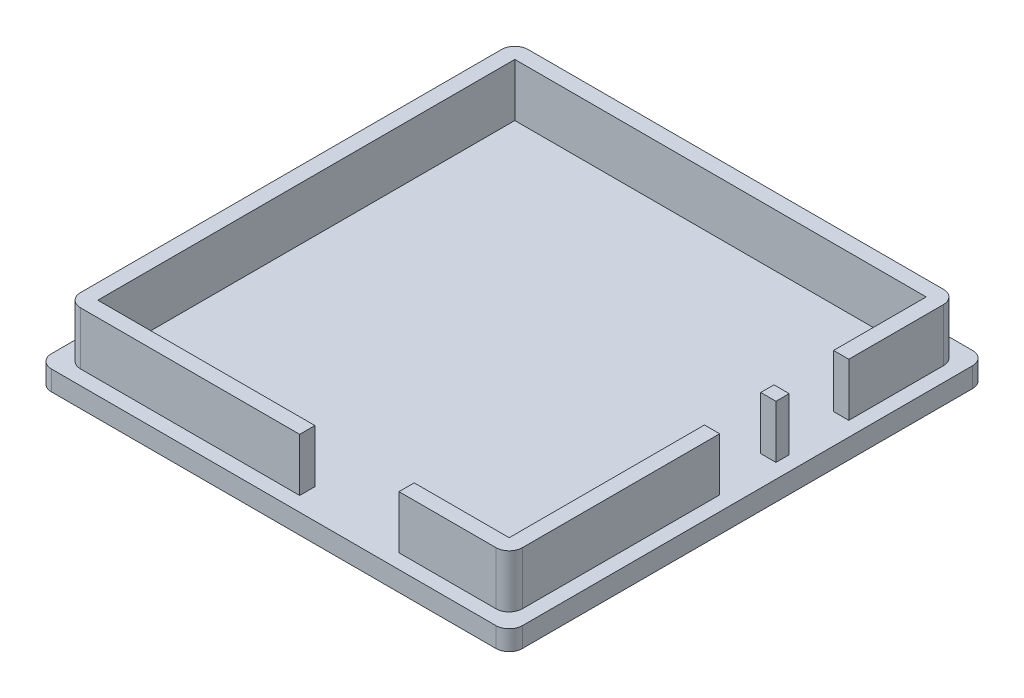
ISO-10303-21;
HEADER;
FILE_DESCRIPTION(('STEP AP214'),'2;1');
FILE_NAME('part.step','',(''),(''),'','','');
FILE_SCHEMA(('AUTOMOTIVE_DESIGN { 1 0 10303 214 1 1 1 1 }'));
ENDSEC;
DATA;
#1=APPLICATION_CONTEXT('core data for automotive mechanical design processes');
#2=APPLICATION_PROTOCOL_DEFINITION('international standard','automotive_design',2000,#1);
#3=PRODUCT_CONTEXT('',#1,'mechanical');
#4=PRODUCT('Part','Part','',(#3));
#5=PRODUCT_RELATED_PRODUCT_CATEGORY('part','',(#4));
#6=PRODUCT_DEFINITION_FORMATION('','',#4);
#7=PRODUCT_DEFINITION_CONTEXT('part definition',#1,'design');
#8=PRODUCT_DEFINITION('design','',#6,#7);
#9=PRODUCT_DEFINITION_SHAPE('','',#8);
#10=(LENGTH_UNIT() NAMED_UNIT(*) SI_UNIT(.MILLI.,.METRE.));
#11=(NAMED_UNIT(*) PLANE_ANGLE_UNIT() SI_UNIT($,.RADIAN.));
#12=(NAMED_UNIT(*) SI_UNIT($,.STERADIAN.) SOLID_ANGLE_UNIT());
#13=UNCERTAINTY_MEASURE_WITH_UNIT(LENGTH_MEASURE(1.E-05),#10,'distance_accuracy_value','');
#14=(GEOMETRIC_REPRESENTATION_CONTEXT(3) GLOBAL_UNCERTAINTY_ASSIGNED_CONTEXT((#13)) GLOBAL_UNIT_ASSIGNED_CONTEXT((#10,
#11,#12)) REPRESENTATION_CONTEXT('',''));
#15=CARTESIAN_POINT('',(0.,0.,0.));
#16=DIRECTION('',(0.,0.,1.));
#17=DIRECTION('',(1.,0.,0.));
#18=AXIS2_PLACEMENT_3D('',#15,#16,#17);
#19=CARTESIAN_POINT('',(0.,9.5,0.));
#20=DIRECTION('',(0.,1.,0.));
#21=DIRECTION('',(0.,0.,1.));
#22=AXIS2_PLACEMENT_3D('',#19,#20,#21);
#23=PLANE('',#22);
#24=DIRECTION('',(0.,0.,-1.));
#25=VECTOR('',#24,1.);
#26=CARTESIAN_POINT('',(16.725,9.5,53.));
#27=LINE('',#26,#25);
#28=CARTESIAN_POINT('',(16.725,9.5,33.8));
#29=VERTEX_POINT('',#28);
#30=CARTESIAN_POINT('',(16.725,9.5,31.5));
#31=VERTEX_POINT('',#30);
#32=EDGE_CURVE('E467',#29,#31,#27,.T.);
#33=ORIENTED_EDGE('',*,*,#32,.F.);
#34=DIRECTION('',(1.,0.,0.));
#35=VECTOR('',#34,1.);
#36=CARTESIAN_POINT('',(-33.375,9.5,33.8));
#37=LINE('',#36,#35);
#38=CARTESIAN_POINT('',(31.375,9.5,33.8));
#39=VERTEX_POINT('',#38);
#40=EDGE_CURVE('E323',#29,#39,#37,.T.);
#41=ORIENTED_EDGE('',*,*,#40,.T.);
#42=CARTESIAN_POINT('',(31.375,9.5,31.8));
#43=DIRECTION('',(0.,1.,0.));
#44=DIRECTION('',(0.,0.,1.));
#45=AXIS2_PLACEMENT_3D('',#42,#43,#44);
#46=CIRCLE('',#45,2.);
#47=CARTESIAN_POINT('',(33.375,9.5,31.8));
#48=VERTEX_POINT('',#47);
#49=EDGE_CURVE('E415',#39,#48,#46,.T.);
#50=ORIENTED_EDGE('',*,*,#49,.T.);
#51=DIRECTION('',(0.,0.,-1.));
#52=VECTOR('',#51,1.);
#53=CARTESIAN_POINT('',(33.375,9.5,33.8));
#54=LINE('',#53,#52);
#55=CARTESIAN_POINT('',(33.375,9.5,2.));
#56=VERTEX_POINT('',#55);
#57=EDGE_CURVE('E324',#48,#56,#54,.T.);
#58=ORIENTED_EDGE('',*,*,#57,.T.);
#59=DIRECTION('',(-1.,0.,0.));
#60=VECTOR('',#59,1.);
#61=CARTESIAN_POINT('',(47.2476175299287,9.5,2.));
#62=LINE('',#61,#60);
#63=CARTESIAN_POINT('',(31.075,9.5,2.));
#64=VERTEX_POINT('',#63);
#65=EDGE_CURVE('E481',#56,#64,#62,.T.);
#66=ORIENTED_EDGE('',*,*,#65,.T.);
#67=DIRECTION('',(0.,0.,-1.));
#68=VECTOR('',#67,1.);
#69=CARTESIAN_POINT('',(31.075,9.5,31.5));
#70=LINE('',#69,#68);
#71=CARTESIAN_POINT('',(31.075,9.5,31.5));
#72=VERTEX_POINT('',#71);
#73=EDGE_CURVE('E515',#72,#64,#70,.T.);
#74=ORIENTED_EDGE('',*,*,#73,.F.);
#75=DIRECTION('',(1.,0.,0.));
#76=VECTOR('',#75,1.);
#77=CARTESIAN_POINT('',(-31.075,9.5,31.5));
#78=LINE('',#77,#76);
#79=EDGE_CURVE('E307',#31,#72,#78,.T.);
#80=ORIENTED_EDGE('',*,*,#79,.F.);
#81=EDGE_LOOP('',(#33,#41,#50,#58,#66,#74,#80));
#82=FACE_BOUND('',#81,.T.);
#83=ADVANCED_FACE('F57',(#82),#23,.T.);
#84=CARTESIAN_POINT('',(-33.375,9.5,33.8));
#85=DIRECTION('',(0.,0.,-1.));
#86=DIRECTION('',(-1.,0.,0.));
#87=AXIS2_PLACEMENT_3D('',#84,#85,#86);
#88=PLANE('',#87);
#89=ORIENTED_EDGE('',*,*,#40,.F.);
#90=DIRECTION('',(0.,-1.,0.));
#91=VECTOR('',#90,1.);
#92=CARTESIAN_POINT('',(16.725,9.5,33.8));
#93=LINE('',#92,#91);
#94=CARTESIAN_POINT('',(16.725,1.5,33.8));
#95=VERTEX_POINT('',#94);
#96=EDGE_CURVE('E466',#29,#95,#93,.T.);
#97=ORIENTED_EDGE('',*,*,#96,.T.);
#98=DIRECTION('',(1.,0.,0.));
#99=VECTOR('',#98,1.);
#100=CARTESIAN_POINT('',(-33.375,1.5,33.8));
#101=LINE('',#100,#99);
#102=CARTESIAN_POINT('',(31.375,1.5,33.8));
#103=VERTEX_POINT('',#102);
#104=EDGE_CURVE('E318',#95,#103,#101,.T.);
#105=ORIENTED_EDGE('',*,*,#104,.T.);
#106=DIRECTION('',(0.,-1.,0.));
#107=VECTOR('',#106,1.);
#108=CARTESIAN_POINT('',(31.375,9.5,33.8));
#109=LINE('',#108,#107);
#110=EDGE_CURVE('E406',#103,#39,#109,.F.);
#111=ORIENTED_EDGE('',*,*,#110,.T.);
#112=EDGE_LOOP('',(#89,#97,#105,#111));
#113=FACE_BOUND('',#112,.T.);
#114=ADVANCED_FACE('F574',(#113),#88,.F.);
#115=CARTESIAN_POINT('',(-31.075,9.5,31.5));
#116=DIRECTION('',(0.,0.,-1.));
#117=DIRECTION('',(-1.,0.,0.));
#118=AXIS2_PLACEMENT_3D('',#115,#116,#117);
#119=PLANE('',#118);
#120=DIRECTION('',(0.,-1.,0.));
#121=VECTOR('',#120,1.);
#122=CARTESIAN_POINT('',(16.725,1.5,31.5));
#123=LINE('',#122,#121);
#124=CARTESIAN_POINT('',(16.725,1.5,31.5));
#125=VERTEX_POINT('',#124);
#126=EDGE_CURVE('E72',#31,#125,#123,.T.);
#127=ORIENTED_EDGE('',*,*,#126,.F.);
#128=ORIENTED_EDGE('',*,*,#79,.T.);
#129=DIRECTION('',(0.,-1.,0.));
#130=VECTOR('',#129,1.);
#131=CARTESIAN_POINT('',(31.075,9.5,31.5));
#132=LINE('',#131,#130);
#133=CARTESIAN_POINT('',(31.075,1.5,31.5));
#134=VERTEX_POINT('',#133);
#135=EDGE_CURVE('E315',#72,#134,#132,.T.);
#136=ORIENTED_EDGE('',*,*,#135,.T.);
#137=DIRECTION('',(1.,0.,0.));
#138=VECTOR('',#137,1.);
#139=CARTESIAN_POINT('',(-31.075,1.5,31.5));
#140=LINE('',#139,#138);
#141=EDGE_CURVE('E293',#125,#134,#140,.T.);
#142=ORIENTED_EDGE('',*,*,#141,.F.);
#143=EDGE_LOOP('',(#127,#128,#136,#142));
#144=FACE_BOUND('',#143,.T.);
#145=ADVANCED_FACE('F580',(#144),#119,.T.);
#146=CARTESIAN_POINT('',(33.375,9.5,33.8));
#147=DIRECTION('',(-1.,0.,0.));
#148=DIRECTION('',(0.,0.,1.));
#149=AXIS2_PLACEMENT_3D('',#146,#147,#148);
#150=PLANE('',#149);
#151=CARTESIAN_POINT('',(33.375,9.5,-6.5));
#152=VERTEX_POINT('',#151);
#153=CARTESIAN_POINT('',(33.375,9.5,-8.5));
#154=VERTEX_POINT('',#153);
#155=EDGE_CURVE('E328',#152,#154,#54,.T.);
#156=ORIENTED_EDGE('',*,*,#155,.F.);
#157=DIRECTION('',(0.,-1.,0.));
#158=VECTOR('',#157,1.);
#159=CARTESIAN_POINT('',(33.375,9.5,-6.5));
#160=LINE('',#159,#158);
#161=CARTESIAN_POINT('',(33.375,1.5,-6.5));
#162=VERTEX_POINT('',#161);
#163=EDGE_CURVE('E489',#152,#162,#160,.T.);
#164=ORIENTED_EDGE('',*,*,#163,.T.);
#165=DIRECTION('',(0.,0.,-1.));
#166=VECTOR('',#165,1.);
#167=CARTESIAN_POINT('',(33.375,1.5,33.8));
#168=LINE('',#167,#166);
#169=CARTESIAN_POINT('',(33.375,1.5,-8.5));
#170=VERTEX_POINT('',#169);
#171=EDGE_CURVE('E342',#162,#170,#168,.T.);
#172=ORIENTED_EDGE('',*,*,#171,.T.);
#173=DIRECTION('',(0.,1.,0.));
#174=VECTOR('',#173,1.);
#175=CARTESIAN_POINT('',(33.375,9.49999999999999,-8.5));
#176=LINE('',#175,#174);
#177=EDGE_CURVE('E298',#170,#154,#176,.T.);
#178=ORIENTED_EDGE('',*,*,#177,.T.);
#179=EDGE_LOOP('',(#156,#164,#172,#178));
#180=FACE_BOUND('',#179,.T.);
#181=ADVANCED_FACE('F557',(#180),#150,.F.);
#182=CARTESIAN_POINT('',(31.075,9.5,31.5));
#183=DIRECTION('',(-1.,0.,0.));
#184=DIRECTION('',(0.,0.,1.));
#185=AXIS2_PLACEMENT_3D('',#182,#183,#184);
#186=PLANE('',#185);
#187=DIRECTION('',(0.,-1.,0.));
#188=VECTOR('',#187,1.);
#189=CARTESIAN_POINT('',(31.075,1.5,-6.5));
#190=LINE('',#189,#188);
#191=CARTESIAN_POINT('',(31.075,9.5,-6.5));
#192=VERTEX_POINT('',#191);
#193=CARTESIAN_POINT('',(31.075,1.5,-6.5));
#194=VERTEX_POINT('',#193);
#195=EDGE_CURVE('E80',#192,#194,#190,.T.);
#196=ORIENTED_EDGE('',*,*,#195,.F.);
#197=CARTESIAN_POINT('',(31.075,9.5,-8.5));
#198=VERTEX_POINT('',#197);
#199=EDGE_CURVE('E518',#192,#198,#70,.T.);
#200=ORIENTED_EDGE('',*,*,#199,.T.);
#201=DIRECTION('',(0.,1.,0.));
#202=VECTOR('',#201,1.);
#203=CARTESIAN_POINT('',(31.075,1.5,-8.5));
#204=LINE('',#203,#202);
#205=CARTESIAN_POINT('',(31.075,1.5,-8.5));
#206=VERTEX_POINT('',#205);
#207=EDGE_CURVE('E492',#206,#198,#204,.T.);
#208=ORIENTED_EDGE('',*,*,#207,.F.);
#209=DIRECTION('',(0.,0.,-1.));
#210=VECTOR('',#209,1.);
#211=CARTESIAN_POINT('',(31.075,1.5,31.5));
#212=LINE('',#211,#210);
#213=EDGE_CURVE('E295',#194,#206,#212,.T.);
#214=ORIENTED_EDGE('',*,*,#213,.F.);
#215=EDGE_LOOP('',(#196,#200,#208,#214));
#216=FACE_BOUND('',#215,.T.);
#217=ADVANCED_FACE('F536',(#216),#186,.T.);
#218=DIRECTION('',(-1.,0.,0.));
#219=VECTOR('',#218,1.);
#220=CARTESIAN_POINT('',(47.2476175299287,9.5,-6.5));
#221=LINE('',#220,#219);
#222=EDGE_CURVE('E478',#152,#192,#221,.T.);
#223=ORIENTED_EDGE('',*,*,#222,.F.);
#224=ORIENTED_EDGE('',*,*,#155,.T.);
#225=DIRECTION('',(-1.,0.,0.));
#226=VECTOR('',#225,1.);
#227=CARTESIAN_POINT('',(47.6165945787923,9.5,-8.5));
#228=LINE('',#227,#226);
#229=EDGE_CURVE('E497',#154,#198,#228,.T.);
#230=ORIENTED_EDGE('',*,*,#229,.T.);
#231=ORIENTED_EDGE('',*,*,#199,.F.);
#232=EDGE_LOOP('',(#223,#224,#230,#231));
#233=FACE_BOUND('',#232,.T.);
#234=ADVANCED_FACE('F545',(#233),#23,.T.);
#235=CARTESIAN_POINT('',(33.375,1.5,31.8));
#236=VERTEX_POINT('',#235);
#237=CARTESIAN_POINT('',(33.375,1.5,2.));
#238=VERTEX_POINT('',#237);
#239=EDGE_CURVE('E338',#236,#238,#168,.T.);
#240=ORIENTED_EDGE('',*,*,#239,.T.);
#241=DIRECTION('',(0.,1.,0.));
#242=VECTOR('',#241,1.);
#243=CARTESIAN_POINT('',(33.375,9.5,2.));
#244=LINE('',#243,#242);
#245=EDGE_CURVE('E480',#238,#56,#244,.T.);
#246=ORIENTED_EDGE('',*,*,#245,.T.);
#247=ORIENTED_EDGE('',*,*,#57,.F.);
#248=DIRECTION('',(0.,-1.,0.));
#249=VECTOR('',#248,1.);
#250=CARTESIAN_POINT('',(33.375,9.5,31.8));
#251=LINE('',#250,#249);
#252=EDGE_CURVE('E400',#48,#236,#251,.T.);
#253=ORIENTED_EDGE('',*,*,#252,.T.);
#254=EDGE_LOOP('',(#240,#246,#247,#253));
#255=FACE_BOUND('',#254,.T.);
#256=ADVANCED_FACE('F587',(#255),#150,.F.);
#257=DIRECTION('',(0.,1.,0.));
#258=VECTOR('',#257,1.);
#259=CARTESIAN_POINT('',(31.075,1.5,2.));
#260=LINE('',#259,#258);
#261=CARTESIAN_POINT('',(31.075,1.5,2.));
#262=VERTEX_POINT('',#261);
#263=EDGE_CURVE('E475',#262,#64,#260,.T.);
#264=ORIENTED_EDGE('',*,*,#263,.F.);
#265=EDGE_CURVE('E297',#134,#262,#212,.T.);
#266=ORIENTED_EDGE('',*,*,#265,.F.);
#267=ORIENTED_EDGE('',*,*,#135,.F.);
#268=ORIENTED_EDGE('',*,*,#73,.T.);
#269=EDGE_LOOP('',(#264,#266,#267,#268));
#270=FACE_BOUND('',#269,.T.);
#271=ADVANCED_FACE('F616',(#270),#186,.T.);
#272=CARTESIAN_POINT('',(35.575,1.5,36.));
#273=DIRECTION('',(-1.,0.,0.));
#274=DIRECTION('',(0.,0.,1.));
#275=AXIS2_PLACEMENT_3D('',#272,#273,#274);
#276=PLANE('',#275);
#277=DIRECTION('',(0.,0.,-1.));
#278=VECTOR('',#277,1.);
#279=CARTESIAN_POINT('',(35.575,1.5,36.));
#280=LINE('',#279,#278);
#281=CARTESIAN_POINT('',(35.575,1.5,34.));
#282=VERTEX_POINT('',#281);
#283=CARTESIAN_POINT('',(35.575,1.5,-34.));
#284=VERTEX_POINT('',#283);
#285=EDGE_CURVE('E348',#282,#284,#280,.T.);
#286=ORIENTED_EDGE('',*,*,#285,.F.);
#287=DIRECTION('',(0.,-1.,0.));
#288=VECTOR('',#287,1.);
#289=CARTESIAN_POINT('',(35.575,1.5,34.));
#290=LINE('',#289,#288);
#291=CARTESIAN_POINT('',(35.575,-1.5,34.));
#292=VERTEX_POINT('',#291);
#293=EDGE_CURVE('E372',#282,#292,#290,.T.);
#294=ORIENTED_EDGE('',*,*,#293,.T.);
#295=DIRECTION('',(0.,0.,-1.));
#296=VECTOR('',#295,1.);
#297=CARTESIAN_POINT('',(35.575,-1.5,36.));
#298=LINE('',#297,#296);
#299=CARTESIAN_POINT('',(35.575,-1.5,-34.));
#300=VERTEX_POINT('',#299);
#301=EDGE_CURVE('E334',#292,#300,#298,.T.);
#302=ORIENTED_EDGE('',*,*,#301,.T.);
#303=DIRECTION('',(0.,-1.,0.));
#304=VECTOR('',#303,1.);
#305=CARTESIAN_POINT('',(35.575,1.5,-34.));
#306=LINE('',#305,#304);
#307=EDGE_CURVE('E359',#300,#284,#306,.F.);
#308=ORIENTED_EDGE('',*,*,#307,.T.);
#309=EDGE_LOOP('',(#286,#294,#302,#308));
#310=FACE_BOUND('',#309,.T.);
#311=ADVANCED_FACE('F612',(#310),#276,.F.);
#312=CARTESIAN_POINT('',(-35.575,1.5,-36.));
#313=DIRECTION('',(0.,0.,1.));
#314=DIRECTION('',(1.,0.,0.));
#315=AXIS2_PLACEMENT_3D('',#312,#313,#314);
#316=PLANE('',#315);
#317=DIRECTION('',(-1.,0.,0.));
#318=VECTOR('',#317,1.);
#319=CARTESIAN_POINT('',(-35.575,1.5,-36.));
#320=LINE('',#319,#318);
#321=CARTESIAN_POINT('',(33.575,1.5,-36.));
#322=VERTEX_POINT('',#321);
#323=CARTESIAN_POINT('',(-33.575,1.5,-36.));
#324=VERTEX_POINT('',#323);
#325=EDGE_CURVE('E350',#322,#324,#320,.T.);
#326=ORIENTED_EDGE('',*,*,#325,.F.);
#327=DIRECTION('',(0.,-1.,0.));
#328=VECTOR('',#327,1.);
#329=CARTESIAN_POINT('',(33.575,1.5,-36.));
#330=LINE('',#329,#328);
#331=CARTESIAN_POINT('',(33.575,-1.5,-36.));
#332=VERTEX_POINT('',#331);
#333=EDGE_CURVE('E419',#322,#332,#330,.T.);
#334=ORIENTED_EDGE('',*,*,#333,.T.);
#335=DIRECTION('',(-1.,0.,0.));
#336=VECTOR('',#335,1.);
#337=CARTESIAN_POINT('',(-35.575,-1.5,-36.));
#338=LINE('',#337,#336);
#339=CARTESIAN_POINT('',(-33.575,-1.5,-36.));
#340=VERTEX_POINT('',#339);
#341=EDGE_CURVE('E362',#332,#340,#338,.T.);
#342=ORIENTED_EDGE('',*,*,#341,.T.);
#343=DIRECTION('',(0.,-1.,0.));
#344=VECTOR('',#343,1.);
#345=CARTESIAN_POINT('',(-33.575,1.5,-36.));
#346=LINE('',#345,#344);
#347=EDGE_CURVE('E417',#340,#324,#346,.F.);
#348=ORIENTED_EDGE('',*,*,#347,.T.);
#349=EDGE_LOOP('',(#326,#334,#342,#348));
#350=FACE_BOUND('',#349,.T.);
#351=ADVANCED_FACE('F608',(#350),#316,.F.);
#352=CARTESIAN_POINT('',(-35.575,1.5,36.));
#353=DIRECTION('',(1.,0.,0.));
#354=DIRECTION('',(0.,0.,-1.));
#355=AXIS2_PLACEMENT_3D('',#352,#353,#354);
#356=PLANE('',#355);
#357=DIRECTION('',(0.,0.,1.));
#358=VECTOR('',#357,1.);
#359=CARTESIAN_POINT('',(-35.575,1.5,36.));
#360=LINE('',#359,#358);
#361=CARTESIAN_POINT('',(-35.575,1.5,-34.));
#362=VERTEX_POINT('',#361);
#363=CARTESIAN_POINT('',(-35.575,1.5,34.));
#364=VERTEX_POINT('',#363);
#365=EDGE_CURVE('E354',#362,#364,#360,.T.);
#366=ORIENTED_EDGE('',*,*,#365,.F.);
#367=DIRECTION('',(0.,-1.,0.));
#368=VECTOR('',#367,1.);
#369=CARTESIAN_POINT('',(-35.575,1.5,-34.));
#370=LINE('',#369,#368);
#371=CARTESIAN_POINT('',(-35.575,-1.5,-34.));
#372=VERTEX_POINT('',#371);
#373=EDGE_CURVE('E429',#362,#372,#370,.T.);
#374=ORIENTED_EDGE('',*,*,#373,.T.);
#375=DIRECTION('',(0.,0.,1.));
#376=VECTOR('',#375,1.);
#377=CARTESIAN_POINT('',(-35.575,-1.5,36.));
#378=LINE('',#377,#376);
#379=CARTESIAN_POINT('',(-35.575,-1.5,34.));
#380=VERTEX_POINT('',#379);
#381=EDGE_CURVE('E365',#372,#380,#378,.T.);
#382=ORIENTED_EDGE('',*,*,#381,.T.);
#383=DIRECTION('',(0.,-1.,0.));
#384=VECTOR('',#383,1.);
#385=CARTESIAN_POINT('',(-35.575,1.5,34.));
#386=LINE('',#385,#384);
#387=EDGE_CURVE('E427',#380,#364,#386,.F.);
#388=ORIENTED_EDGE('',*,*,#387,.T.);
#389=EDGE_LOOP('',(#366,#374,#382,#388));
#390=FACE_BOUND('',#389,.T.);
#391=ADVANCED_FACE('F600',(#390),#356,.F.);
#392=CARTESIAN_POINT('',(-35.575,1.5,36.));
#393=DIRECTION('',(0.,0.,-1.));
#394=DIRECTION('',(-1.,0.,0.));
#395=AXIS2_PLACEMENT_3D('',#392,#393,#394);
#396=PLANE('',#395);
#397=DIRECTION('',(1.,0.,0.));
#398=VECTOR('',#397,1.);
#399=CARTESIAN_POINT('',(-35.575,-1.5,36.));
#400=LINE('',#399,#398);
#401=CARTESIAN_POINT('',(-33.575,-1.5,36.));
#402=VERTEX_POINT('',#401);
#403=CARTESIAN_POINT('',(33.575,-1.5,36.));
#404=VERTEX_POINT('',#403);
#405=EDGE_CURVE('E351',#402,#404,#400,.T.);
#406=ORIENTED_EDGE('',*,*,#405,.T.);
#407=DIRECTION('',(0.,-1.,0.));
#408=VECTOR('',#407,1.);
#409=CARTESIAN_POINT('',(33.575,1.5,36.));
#410=LINE('',#409,#408);
#411=CARTESIAN_POINT('',(33.575,1.5,36.));
#412=VERTEX_POINT('',#411);
#413=EDGE_CURVE('E386',#404,#412,#410,.F.);
#414=ORIENTED_EDGE('',*,*,#413,.T.);
#415=DIRECTION('',(1.,0.,0.));
#416=VECTOR('',#415,1.);
#417=CARTESIAN_POINT('',(-35.575,1.5,36.));
#418=LINE('',#417,#416);
#419=CARTESIAN_POINT('',(-33.575,1.5,36.));
#420=VERTEX_POINT('',#419);
#421=EDGE_CURVE('E357',#420,#412,#418,.T.);
#422=ORIENTED_EDGE('',*,*,#421,.F.);
#423=DIRECTION('',(0.,-1.,0.));
#424=VECTOR('',#423,1.);
#425=CARTESIAN_POINT('',(-33.575,1.5,36.));
#426=LINE('',#425,#424);
#427=EDGE_CURVE('E383',#420,#402,#426,.T.);
#428=ORIENTED_EDGE('',*,*,#427,.T.);
#429=EDGE_LOOP('',(#406,#414,#422,#428));
#430=FACE_BOUND('',#429,.T.);
#431=ADVANCED_FACE('F594',(#430),#396,.F.);
#432=CARTESIAN_POINT('',(0.,-1.5,0.));
#433=DIRECTION('',(0.,-1.,0.));
#434=DIRECTION('',(0.,0.,-1.));
#435=AXIS2_PLACEMENT_3D('',#432,#433,#434);
#436=PLANE('',#435);
#437=ORIENTED_EDGE('',*,*,#301,.F.);
#438=CARTESIAN_POINT('',(33.575,-1.5,34.));
#439=DIRECTION('',(0.,-1.,0.));
#440=DIRECTION('',(0.,0.,-1.));
#441=AXIS2_PLACEMENT_3D('',#438,#439,#440);
#442=CIRCLE('',#441,2.);
#443=EDGE_CURVE('E381',#292,#404,#442,.T.);
#444=ORIENTED_EDGE('',*,*,#443,.T.);
#445=ORIENTED_EDGE('',*,*,#405,.F.);
#446=CARTESIAN_POINT('',(-33.575,-1.5,34.));
#447=DIRECTION('',(0.,-1.,0.));
#448=DIRECTION('',(0.,0.,-1.));
#449=AXIS2_PLACEMENT_3D('',#446,#447,#448);
#450=CIRCLE('',#449,2.);
#451=EDGE_CURVE('E375',#402,#380,#450,.T.);
#452=ORIENTED_EDGE('',*,*,#451,.T.);
#453=ORIENTED_EDGE('',*,*,#381,.F.);
#454=CARTESIAN_POINT('',(-33.575,-1.5,-34.));
#455=DIRECTION('',(0.,-1.,0.));
#456=DIRECTION('',(0.,0.,-1.));
#457=AXIS2_PLACEMENT_3D('',#454,#455,#456);
#458=CIRCLE('',#457,2.);
#459=EDGE_CURVE('E377',#372,#340,#458,.T.);
#460=ORIENTED_EDGE('',*,*,#459,.T.);
#461=ORIENTED_EDGE('',*,*,#341,.F.);
#462=CARTESIAN_POINT('',(33.575,-1.5,-34.));
#463=DIRECTION('',(0.,-1.,0.));
#464=DIRECTION('',(0.,0.,-1.));
#465=AXIS2_PLACEMENT_3D('',#462,#463,#464);
#466=CIRCLE('',#465,2.);
#467=EDGE_CURVE('E379',#332,#300,#466,.T.);
#468=ORIENTED_EDGE('',*,*,#467,.T.);
#469=EDGE_LOOP('',(#437,#444,#445,#452,#453,#460,#461,#468));
#470=FACE_BOUND('',#469,.T.);
#471=ADVANCED_FACE('F589',(#470),#436,.T.);
#472=DIRECTION('',(0.,0.,-1.));
#473=VECTOR('',#472,1.);
#474=CARTESIAN_POINT('',(1.72499999999999,9.5,53.));
#475=LINE('',#474,#473);
#476=CARTESIAN_POINT('',(1.72499999999999,9.5,33.8));
#477=VERTEX_POINT('',#476);
#478=CARTESIAN_POINT('',(1.72499999999999,9.5,31.5));
#479=VERTEX_POINT('',#478);
#480=EDGE_CURVE('E275',#477,#479,#475,.T.);
#481=ORIENTED_EDGE('',*,*,#480,.T.);
#482=CARTESIAN_POINT('',(-31.075,9.5,31.5));
#483=VERTEX_POINT('',#482);
#484=EDGE_CURVE('E286',#483,#479,#78,.T.);
#485=ORIENTED_EDGE('',*,*,#484,.F.);
#486=DIRECTION('',(0.,0.,1.));
#487=VECTOR('',#486,1.);
#488=CARTESIAN_POINT('',(-31.075,9.5,-31.5));
#489=LINE('',#488,#487);
#490=CARTESIAN_POINT('',(-31.075,9.5,-31.5));
#491=VERTEX_POINT('',#490);
#492=EDGE_CURVE('E300',#491,#483,#489,.T.);
#493=ORIENTED_EDGE('',*,*,#492,.F.);
#494=DIRECTION('',(-1.,0.,0.));
#495=VECTOR('',#494,1.);
#496=CARTESIAN_POINT('',(31.075,9.5,-31.5));
#497=LINE('',#496,#495);
#498=CARTESIAN_POINT('',(31.075,9.5,-31.5));
#499=VERTEX_POINT('',#498);
#500=EDGE_CURVE('E517',#499,#491,#497,.T.);
#501=ORIENTED_EDGE('',*,*,#500,.F.);
#502=CARTESIAN_POINT('',(31.075,9.5,-17.5));
#503=VERTEX_POINT('',#502);
#504=EDGE_CURVE('E514',#503,#499,#70,.T.);
#505=ORIENTED_EDGE('',*,*,#504,.F.);
#506=DIRECTION('',(-1.,0.,0.));
#507=VECTOR('',#506,1.);
#508=CARTESIAN_POINT('',(47.6165945787923,9.5,-17.5));
#509=LINE('',#508,#507);
#510=CARTESIAN_POINT('',(33.375,9.5,-17.5));
#511=VERTEX_POINT('',#510);
#512=EDGE_CURVE('E505',#511,#503,#509,.T.);
#513=ORIENTED_EDGE('',*,*,#512,.F.);
#514=CARTESIAN_POINT('',(33.375,9.5,-31.8));
#515=VERTEX_POINT('',#514);
#516=EDGE_CURVE('E322',#511,#515,#54,.T.);
#517=ORIENTED_EDGE('',*,*,#516,.T.);
#518=CARTESIAN_POINT('',(31.375,9.5,-31.8));
#519=DIRECTION('',(0.,1.,0.));
#520=DIRECTION('',(0.,0.,1.));
#521=AXIS2_PLACEMENT_3D('',#518,#519,#520);
#522=CIRCLE('',#521,2.);
#523=CARTESIAN_POINT('',(31.375,9.5,-33.8));
#524=VERTEX_POINT('',#523);
#525=EDGE_CURVE('E413',#515,#524,#522,.T.);
#526=ORIENTED_EDGE('',*,*,#525,.T.);
#527=DIRECTION('',(-1.,0.,0.));
#528=VECTOR('',#527,1.);
#529=CARTESIAN_POINT('',(33.375,9.5,-33.8));
#530=LINE('',#529,#528);
#531=CARTESIAN_POINT('',(-31.375,9.5,-33.8));
#532=VERTEX_POINT('',#531);
#533=EDGE_CURVE('E327',#524,#532,#530,.T.);
#534=ORIENTED_EDGE('',*,*,#533,.T.);
#535=CARTESIAN_POINT('',(-31.375,9.5,-31.8));
#536=DIRECTION('',(0.,1.,0.));
#537=DIRECTION('',(0.,0.,1.));
#538=AXIS2_PLACEMENT_3D('',#535,#536,#537);
#539=CIRCLE('',#538,2.);
#540=CARTESIAN_POINT('',(-33.375,9.5,-31.8));
#541=VERTEX_POINT('',#540);
#542=EDGE_CURVE('E411',#532,#541,#539,.T.);
#543=ORIENTED_EDGE('',*,*,#542,.T.);
#544=DIRECTION('',(0.,0.,1.));
#545=VECTOR('',#544,1.);
#546=CARTESIAN_POINT('',(-33.375,9.5,-33.8));
#547=LINE('',#546,#545);
#548=CARTESIAN_POINT('',(-33.375,9.5,31.8));
#549=VERTEX_POINT('',#548);
#550=EDGE_CURVE('E331',#541,#549,#547,.T.);
#551=ORIENTED_EDGE('',*,*,#550,.T.);
#552=CARTESIAN_POINT('',(-31.375,9.5,31.8));
#553=DIRECTION('',(0.,1.,0.));
#554=DIRECTION('',(0.,0.,1.));
#555=AXIS2_PLACEMENT_3D('',#552,#553,#554);
#556=CIRCLE('',#555,2.);
#557=CARTESIAN_POINT('',(-31.375,9.5,33.8));
#558=VERTEX_POINT('',#557);
#559=EDGE_CURVE('E409',#549,#558,#556,.T.);
#560=ORIENTED_EDGE('',*,*,#559,.T.);
#561=EDGE_CURVE('E319',#558,#477,#37,.T.);
#562=ORIENTED_EDGE('',*,*,#561,.T.);
#563=EDGE_LOOP('',(#481,#485,#493,#501,#505,#513,#517,#526,#534,#543,#551,#560,#562));
#564=FACE_BOUND('',#563,.T.);
#565=ADVANCED_FACE('F455',(#564),#23,.T.);
#566=CARTESIAN_POINT('',(-31.375,1.5,33.8));
#567=VERTEX_POINT('',#566);
#568=CARTESIAN_POINT('',(1.72499999999999,1.5,33.8));
#569=VERTEX_POINT('',#568);
#570=EDGE_CURVE('E335',#567,#569,#101,.T.);
#571=ORIENTED_EDGE('',*,*,#570,.T.);
#572=DIRECTION('',(0.,1.,0.));
#573=VECTOR('',#572,1.);
#574=CARTESIAN_POINT('',(1.725,9.5,33.8));
#575=LINE('',#574,#573);
#576=EDGE_CURVE('E270',#569,#477,#575,.T.);
#577=ORIENTED_EDGE('',*,*,#576,.T.);
#578=ORIENTED_EDGE('',*,*,#561,.F.);
#579=DIRECTION('',(0.,-1.,0.));
#580=VECTOR('',#579,1.);
#581=CARTESIAN_POINT('',(-31.375,9.5,33.8));
#582=LINE('',#581,#580);
#583=EDGE_CURVE('E403',#558,#567,#582,.T.);
#584=ORIENTED_EDGE('',*,*,#583,.T.);
#585=EDGE_LOOP('',(#571,#577,#578,#584));
#586=FACE_BOUND('',#585,.T.);
#587=ADVANCED_FACE('F465',(#586),#88,.F.);
#588=ORIENTED_EDGE('',*,*,#516,.F.);
#589=DIRECTION('',(0.,-1.,0.));
#590=VECTOR('',#589,1.);
#591=CARTESIAN_POINT('',(33.375,9.5,-17.5));
#592=LINE('',#591,#590);
#593=CARTESIAN_POINT('',(33.375,1.5,-17.5));
#594=VERTEX_POINT('',#593);
#595=EDGE_CURVE('E501',#511,#594,#592,.T.);
#596=ORIENTED_EDGE('',*,*,#595,.T.);
#597=CARTESIAN_POINT('',(33.375,1.5,-31.8));
#598=VERTEX_POINT('',#597);
#599=EDGE_CURVE('E337',#594,#598,#168,.T.);
#600=ORIENTED_EDGE('',*,*,#599,.T.);
#601=DIRECTION('',(0.,-1.,0.));
#602=VECTOR('',#601,1.);
#603=CARTESIAN_POINT('',(33.375,9.5,-31.8));
#604=LINE('',#603,#602);
#605=EDGE_CURVE('E397',#598,#515,#604,.F.);
#606=ORIENTED_EDGE('',*,*,#605,.T.);
#607=EDGE_LOOP('',(#588,#596,#600,#606));
#608=FACE_BOUND('',#607,.T.);
#609=ADVANCED_FACE('F551',(#608),#150,.F.);
#610=CARTESIAN_POINT('',(33.375,9.5,-33.8));
#611=DIRECTION('',(0.,0.,1.));
#612=DIRECTION('',(1.,0.,0.));
#613=AXIS2_PLACEMENT_3D('',#610,#611,#612);
#614=PLANE('',#613);
#615=ORIENTED_EDGE('',*,*,#533,.F.);
#616=DIRECTION('',(0.,-1.,0.));
#617=VECTOR('',#616,1.);
#618=CARTESIAN_POINT('',(31.375,9.5,-33.8));
#619=LINE('',#618,#617);
#620=CARTESIAN_POINT('',(31.375,1.5,-33.8));
#621=VERTEX_POINT('',#620);
#622=EDGE_CURVE('E424',#524,#621,#619,.T.);
#623=ORIENTED_EDGE('',*,*,#622,.T.);
#624=DIRECTION('',(-1.,0.,0.));
#625=VECTOR('',#624,1.);
#626=CARTESIAN_POINT('',(33.375,1.5,-33.8));
#627=LINE('',#626,#625);
#628=CARTESIAN_POINT('',(-31.375,1.5,-33.8));
#629=VERTEX_POINT('',#628);
#630=EDGE_CURVE('E341',#621,#629,#627,.T.);
#631=ORIENTED_EDGE('',*,*,#630,.T.);
#632=DIRECTION('',(0.,-1.,0.));
#633=VECTOR('',#632,1.);
#634=CARTESIAN_POINT('',(-31.375,9.5,-33.8));
#635=LINE('',#634,#633);
#636=EDGE_CURVE('E422',#629,#532,#635,.F.);
#637=ORIENTED_EDGE('',*,*,#636,.T.);
#638=EDGE_LOOP('',(#615,#623,#631,#637));
#639=FACE_BOUND('',#638,.T.);
#640=ADVANCED_FACE('F449',(#639),#614,.F.);
#641=CARTESIAN_POINT('',(-33.375,9.5,-33.8));
#642=DIRECTION('',(1.,0.,0.));
#643=DIRECTION('',(0.,0.,-1.));
#644=AXIS2_PLACEMENT_3D('',#641,#642,#643);
#645=PLANE('',#644);
#646=ORIENTED_EDGE('',*,*,#550,.F.);
#647=DIRECTION('',(0.,-1.,0.));
#648=VECTOR('',#647,1.);
#649=CARTESIAN_POINT('',(-33.375,9.5,-31.8));
#650=LINE('',#649,#648);
#651=CARTESIAN_POINT('',(-33.375,1.5,-31.8));
#652=VERTEX_POINT('',#651);
#653=EDGE_CURVE('E434',#541,#652,#650,.T.);
#654=ORIENTED_EDGE('',*,*,#653,.T.);
#655=DIRECTION('',(0.,0.,1.));
#656=VECTOR('',#655,1.);
#657=CARTESIAN_POINT('',(-33.375,1.5,-33.8));
#658=LINE('',#657,#656);
#659=CARTESIAN_POINT('',(-33.375,1.5,31.8));
#660=VERTEX_POINT('',#659);
#661=EDGE_CURVE('E345',#652,#660,#658,.T.);
#662=ORIENTED_EDGE('',*,*,#661,.T.);
#663=DIRECTION('',(0.,-1.,0.));
#664=VECTOR('',#663,1.);
#665=CARTESIAN_POINT('',(-33.375,9.5,31.8));
#666=LINE('',#665,#664);
#667=EDGE_CURVE('E432',#660,#549,#666,.F.);
#668=ORIENTED_EDGE('',*,*,#667,.T.);
#669=EDGE_LOOP('',(#646,#654,#662,#668));
#670=FACE_BOUND('',#669,.T.);
#671=ADVANCED_FACE('F458',(#670),#645,.F.);
#672=DIRECTION('',(0.,1.,0.));
#673=VECTOR('',#672,1.);
#674=CARTESIAN_POINT('',(1.72499999999999,1.5,31.5));
#675=LINE('',#674,#673);
#676=CARTESIAN_POINT('',(1.72499999999999,1.5,31.5));
#677=VERTEX_POINT('',#676);
#678=EDGE_CURVE('E267',#677,#479,#675,.T.);
#679=ORIENTED_EDGE('',*,*,#678,.F.);
#680=CARTESIAN_POINT('',(-31.075,1.5,31.5));
#681=VERTEX_POINT('',#680);
#682=EDGE_CURVE('E283',#681,#677,#140,.T.);
#683=ORIENTED_EDGE('',*,*,#682,.F.);
#684=DIRECTION('',(0.,-1.,0.));
#685=VECTOR('',#684,1.);
#686=CARTESIAN_POINT('',(-31.075,9.5,31.5));
#687=LINE('',#686,#685);
#688=EDGE_CURVE('E308',#483,#681,#687,.T.);
#689=ORIENTED_EDGE('',*,*,#688,.F.);
#690=ORIENTED_EDGE('',*,*,#484,.T.);
#691=EDGE_LOOP('',(#679,#683,#689,#690));
#692=FACE_BOUND('',#691,.T.);
#693=ADVANCED_FACE('F281',(#692),#119,.T.);
#694=DIRECTION('',(0.,-1.,0.));
#695=VECTOR('',#694,1.);
#696=CARTESIAN_POINT('',(31.075,1.5,-17.5));
#697=LINE('',#696,#695);
#698=CARTESIAN_POINT('',(31.075,1.5,-17.5));
#699=VERTEX_POINT('',#698);
#700=EDGE_CURVE('E495',#503,#699,#697,.T.);
#701=ORIENTED_EDGE('',*,*,#700,.F.);
#702=ORIENTED_EDGE('',*,*,#504,.T.);
#703=DIRECTION('',(0.,-1.,0.));
#704=VECTOR('',#703,1.);
#705=CARTESIAN_POINT('',(31.075,9.5,-31.5));
#706=LINE('',#705,#704);
#707=CARTESIAN_POINT('',(31.075,1.5,-31.5));
#708=VERTEX_POINT('',#707);
#709=EDGE_CURVE('E312',#499,#708,#706,.T.);
#710=ORIENTED_EDGE('',*,*,#709,.T.);
#711=EDGE_CURVE('E292',#699,#708,#212,.T.);
#712=ORIENTED_EDGE('',*,*,#711,.F.);
#713=EDGE_LOOP('',(#701,#702,#710,#712));
#714=FACE_BOUND('',#713,.T.);
#715=ADVANCED_FACE('F696',(#714),#186,.T.);
#716=CARTESIAN_POINT('',(31.075,9.5,-31.5));
#717=DIRECTION('',(0.,0.,1.));
#718=DIRECTION('',(1.,0.,0.));
#719=AXIS2_PLACEMENT_3D('',#716,#717,#718);
#720=PLANE('',#719);
#721=DIRECTION('',(-1.,0.,0.));
#722=VECTOR('',#721,1.);
#723=CARTESIAN_POINT('',(31.075,1.5,-31.5));
#724=LINE('',#723,#722);
#725=CARTESIAN_POINT('',(-31.075,1.5,-31.5));
#726=VERTEX_POINT('',#725);
#727=EDGE_CURVE('E304',#708,#726,#724,.T.);
#728=ORIENTED_EDGE('',*,*,#727,.F.);
#729=ORIENTED_EDGE('',*,*,#709,.F.);
#730=ORIENTED_EDGE('',*,*,#500,.T.);
#731=DIRECTION('',(0.,-1.,0.));
#732=VECTOR('',#731,1.);
#733=CARTESIAN_POINT('',(-31.075,9.5,-31.5));
#734=LINE('',#733,#732);
#735=EDGE_CURVE('E310',#491,#726,#734,.T.);
#736=ORIENTED_EDGE('',*,*,#735,.T.);
#737=EDGE_LOOP('',(#728,#729,#730,#736));
#738=FACE_BOUND('',#737,.T.);
#739=ADVANCED_FACE('F671',(#738),#720,.T.);
#740=CARTESIAN_POINT('',(-31.075,9.5,-31.5));
#741=DIRECTION('',(1.,0.,0.));
#742=DIRECTION('',(0.,0.,-1.));
#743=AXIS2_PLACEMENT_3D('',#740,#741,#742);
#744=PLANE('',#743);
#745=DIRECTION('',(0.,0.,1.));
#746=VECTOR('',#745,1.);
#747=CARTESIAN_POINT('',(-31.075,1.5,-31.5));
#748=LINE('',#747,#746);
#749=EDGE_CURVE('E291',#726,#681,#748,.T.);
#750=ORIENTED_EDGE('',*,*,#749,.F.);
#751=ORIENTED_EDGE('',*,*,#735,.F.);
#752=ORIENTED_EDGE('',*,*,#492,.T.);
#753=ORIENTED_EDGE('',*,*,#688,.T.);
#754=EDGE_LOOP('',(#750,#751,#752,#753));
#755=FACE_BOUND('',#754,.T.);
#756=ADVANCED_FACE('F525',(#755),#744,.T.);
#757=CARTESIAN_POINT('',(0.,1.5,0.));
#758=DIRECTION('',(0.,-1.,0.));
#759=DIRECTION('',(0.,0.,-1.));
#760=AXIS2_PLACEMENT_3D('',#757,#758,#759);
#761=PLANE('',#760);
#762=ORIENTED_EDGE('',*,*,#104,.F.);
#763=DIRECTION('',(0.,0.,-1.));
#764=VECTOR('',#763,1.);
#765=CARTESIAN_POINT('',(16.725,1.5,53.));
#766=LINE('',#765,#764);
#767=EDGE_CURVE('E276',#95,#125,#766,.T.);
#768=ORIENTED_EDGE('',*,*,#767,.T.);
#769=ORIENTED_EDGE('',*,*,#141,.T.);
#770=ORIENTED_EDGE('',*,*,#265,.T.);
#771=DIRECTION('',(-1.,0.,0.));
#772=VECTOR('',#771,1.);
#773=CARTESIAN_POINT('',(47.2476175299287,1.5,2.));
#774=LINE('',#773,#772);
#775=EDGE_CURVE('E484',#238,#262,#774,.T.);
#776=ORIENTED_EDGE('',*,*,#775,.F.);
#777=ORIENTED_EDGE('',*,*,#239,.F.);
#778=CARTESIAN_POINT('',(31.375,1.5,31.8));
#779=DIRECTION('',(0.,-1.,0.));
#780=DIRECTION('',(0.,0.,-1.));
#781=AXIS2_PLACEMENT_3D('',#778,#779,#780);
#782=CIRCLE('',#781,2.);
#783=EDGE_CURVE('E437',#236,#103,#782,.T.);
#784=ORIENTED_EDGE('',*,*,#783,.T.);
#785=EDGE_LOOP('',(#762,#768,#769,#770,#776,#777,#784));
#786=FACE_BOUND('',#785,.T.);
#787=ORIENTED_EDGE('',*,*,#421,.T.);
#788=CARTESIAN_POINT('',(33.575,1.5,34.));
#789=DIRECTION('',(0.,-1.,0.));
#790=DIRECTION('',(0.,0.,-1.));
#791=AXIS2_PLACEMENT_3D('',#788,#789,#790);
#792=CIRCLE('',#791,2.);
#793=EDGE_CURVE('E395',#412,#282,#792,.F.);
#794=ORIENTED_EDGE('',*,*,#793,.T.);
#795=ORIENTED_EDGE('',*,*,#285,.T.);
#796=CARTESIAN_POINT('',(33.575,1.5,-34.));
#797=DIRECTION('',(0.,-1.,0.));
#798=DIRECTION('',(0.,0.,-1.));
#799=AXIS2_PLACEMENT_3D('',#796,#797,#798);
#800=CIRCLE('',#799,2.);
#801=EDGE_CURVE('E393',#284,#322,#800,.F.);
#802=ORIENTED_EDGE('',*,*,#801,.T.);
#803=ORIENTED_EDGE('',*,*,#325,.T.);
#804=CARTESIAN_POINT('',(-33.575,1.5,-34.));
#805=DIRECTION('',(0.,-1.,0.));
#806=DIRECTION('',(0.,0.,-1.));
#807=AXIS2_PLACEMENT_3D('',#804,#805,#806);
#808=CIRCLE('',#807,2.);
#809=EDGE_CURVE('E391',#324,#362,#808,.F.);
#810=ORIENTED_EDGE('',*,*,#809,.T.);
#811=ORIENTED_EDGE('',*,*,#365,.T.);
#812=CARTESIAN_POINT('',(-33.575,1.5,34.));
#813=DIRECTION('',(0.,-1.,0.));
#814=DIRECTION('',(0.,0.,-1.));
#815=AXIS2_PLACEMENT_3D('',#812,#813,#814);
#816=CIRCLE('',#815,2.);
#817=EDGE_CURVE('E389',#364,#420,#816,.F.);
#818=ORIENTED_EDGE('',*,*,#817,.T.);
#819=EDGE_LOOP('',(#787,#794,#795,#802,#803,#810,#811,#818));
#820=FACE_BOUND('',#819,.T.);
#821=ORIENTED_EDGE('',*,*,#171,.F.);
#822=DIRECTION('',(-1.,0.,0.));
#823=VECTOR('',#822,1.);
#824=CARTESIAN_POINT('',(47.2476175299287,1.5,-6.5));
#825=LINE('',#824,#823);
#826=EDGE_CURVE('E477',#162,#194,#825,.T.);
#827=ORIENTED_EDGE('',*,*,#826,.T.);
#828=ORIENTED_EDGE('',*,*,#213,.T.);
#829=DIRECTION('',(-1.,0.,0.));
#830=VECTOR('',#829,1.);
#831=CARTESIAN_POINT('',(47.6165945787923,1.5,-8.5));
#832=LINE('',#831,#830);
#833=EDGE_CURVE('E498',#170,#206,#832,.T.);
#834=ORIENTED_EDGE('',*,*,#833,.F.);
#835=EDGE_LOOP('',(#821,#827,#828,#834));
#836=FACE_BOUND('',#835,.T.);
#837=DIRECTION('',(0.,0.,-1.));
#838=VECTOR('',#837,1.);
#839=CARTESIAN_POINT('',(1.72499999999999,1.5,53.));
#840=LINE('',#839,#838);
#841=EDGE_CURVE('E264',#569,#677,#840,.T.);
#842=ORIENTED_EDGE('',*,*,#841,.F.);
#843=ORIENTED_EDGE('',*,*,#570,.F.);
#844=CARTESIAN_POINT('',(-31.375,1.5,31.8));
#845=DIRECTION('',(0.,-1.,0.));
#846=DIRECTION('',(0.,0.,-1.));
#847=AXIS2_PLACEMENT_3D('',#844,#845,#846);
#848=CIRCLE('',#847,2.);
#849=EDGE_CURVE('E12',#567,#660,#848,.T.);
#850=ORIENTED_EDGE('',*,*,#849,.T.);
#851=ORIENTED_EDGE('',*,*,#661,.F.);
#852=CARTESIAN_POINT('',(-31.375,1.5,-31.8));
#853=DIRECTION('',(0.,-1.,0.));
#854=DIRECTION('',(0.,0.,-1.));
#855=AXIS2_PLACEMENT_3D('',#852,#853,#854);
#856=CIRCLE('',#855,2.);
#857=EDGE_CURVE('E65',#652,#629,#856,.T.);
#858=ORIENTED_EDGE('',*,*,#857,.T.);
#859=ORIENTED_EDGE('',*,*,#630,.F.);
#860=CARTESIAN_POINT('',(31.375,1.5,-31.8));
#861=DIRECTION('',(0.,-1.,0.));
#862=DIRECTION('',(0.,0.,-1.));
#863=AXIS2_PLACEMENT_3D('',#860,#861,#862);
#864=CIRCLE('',#863,2.);
#865=EDGE_CURVE('E440',#621,#598,#864,.T.);
#866=ORIENTED_EDGE('',*,*,#865,.T.);
#867=ORIENTED_EDGE('',*,*,#599,.F.);
#868=DIRECTION('',(-1.,0.,0.));
#869=VECTOR('',#868,1.);
#870=CARTESIAN_POINT('',(47.6165945787923,1.5,-17.5));
#871=LINE('',#870,#869);
#872=EDGE_CURVE('E502',#594,#699,#871,.T.);
#873=ORIENTED_EDGE('',*,*,#872,.T.);
#874=ORIENTED_EDGE('',*,*,#711,.T.);
#875=ORIENTED_EDGE('',*,*,#727,.T.);
#876=ORIENTED_EDGE('',*,*,#749,.T.);
#877=ORIENTED_EDGE('',*,*,#682,.T.);
#878=EDGE_LOOP('',(#842,#843,#850,#851,#858,#859,#866,#867,#873,#874,#875,#876,#877));
#879=FACE_BOUND('',#878,.T.);
#880=ADVANCED_FACE('F288',(#786,#820,#836,#879),#761,.F.);
#881=CARTESIAN_POINT('',(33.575,1.5,34.));
#882=DIRECTION('',(0.,-1.,0.));
#883=DIRECTION('',(0.,0.,-1.));
#884=AXIS2_PLACEMENT_3D('',#881,#882,#883);
#885=CYLINDRICAL_SURFACE('',#884,2.);
#886=ORIENTED_EDGE('',*,*,#793,.F.);
#887=ORIENTED_EDGE('',*,*,#413,.F.);
#888=ORIENTED_EDGE('',*,*,#443,.F.);
#889=ORIENTED_EDGE('',*,*,#293,.F.);
#890=EDGE_LOOP('',(#886,#887,#888,#889));
#891=FACE_BOUND('',#890,.T.);
#892=ADVANCED_FACE('F618',(#891),#885,.T.);
#893=CARTESIAN_POINT('',(31.375,9.5,31.8));
#894=DIRECTION('',(0.,-1.,0.));
#895=DIRECTION('',(0.,0.,-1.));
#896=AXIS2_PLACEMENT_3D('',#893,#894,#895);
#897=CYLINDRICAL_SURFACE('',#896,2.);
#898=ORIENTED_EDGE('',*,*,#49,.F.);
#899=ORIENTED_EDGE('',*,*,#110,.F.);
#900=ORIENTED_EDGE('',*,*,#783,.F.);
#901=ORIENTED_EDGE('',*,*,#252,.F.);
#902=EDGE_LOOP('',(#898,#899,#900,#901));
#903=FACE_BOUND('',#902,.T.);
#904=ADVANCED_FACE('F621',(#903),#897,.T.);
#905=CARTESIAN_POINT('',(33.575,1.5,-34.));
#906=DIRECTION('',(0.,-1.,0.));
#907=DIRECTION('',(0.,0.,-1.));
#908=AXIS2_PLACEMENT_3D('',#905,#906,#907);
#909=CYLINDRICAL_SURFACE('',#908,2.);
#910=ORIENTED_EDGE('',*,*,#801,.F.);
#911=ORIENTED_EDGE('',*,*,#307,.F.);
#912=ORIENTED_EDGE('',*,*,#467,.F.);
#913=ORIENTED_EDGE('',*,*,#333,.F.);
#914=EDGE_LOOP('',(#910,#911,#912,#913));
#915=FACE_BOUND('',#914,.T.);
#916=ADVANCED_FACE('F625',(#915),#909,.T.);
#917=CARTESIAN_POINT('',(31.375,9.5,-31.8));
#918=DIRECTION('',(0.,-1.,0.));
#919=DIRECTION('',(0.,0.,-1.));
#920=AXIS2_PLACEMENT_3D('',#917,#918,#919);
#921=CYLINDRICAL_SURFACE('',#920,2.);
#922=ORIENTED_EDGE('',*,*,#525,.F.);
#923=ORIENTED_EDGE('',*,*,#605,.F.);
#924=ORIENTED_EDGE('',*,*,#865,.F.);
#925=ORIENTED_EDGE('',*,*,#622,.F.);
#926=EDGE_LOOP('',(#922,#923,#924,#925));
#927=FACE_BOUND('',#926,.T.);
#928=ADVANCED_FACE('F554',(#927),#921,.T.);
#929=CARTESIAN_POINT('',(-33.575,1.5,-34.));
#930=DIRECTION('',(0.,-1.,0.));
#931=DIRECTION('',(0.,0.,-1.));
#932=AXIS2_PLACEMENT_3D('',#929,#930,#931);
#933=CYLINDRICAL_SURFACE('',#932,2.);
#934=ORIENTED_EDGE('',*,*,#809,.F.);
#935=ORIENTED_EDGE('',*,*,#347,.F.);
#936=ORIENTED_EDGE('',*,*,#459,.F.);
#937=ORIENTED_EDGE('',*,*,#373,.F.);
#938=EDGE_LOOP('',(#934,#935,#936,#937));
#939=FACE_BOUND('',#938,.T.);
#940=ADVANCED_FACE('F632',(#939),#933,.T.);
#941=CARTESIAN_POINT('',(-31.375,9.5,-31.8));
#942=DIRECTION('',(0.,-1.,0.));
#943=DIRECTION('',(0.,0.,-1.));
#944=AXIS2_PLACEMENT_3D('',#941,#942,#943);
#945=CYLINDRICAL_SURFACE('',#944,2.);
#946=ORIENTED_EDGE('',*,*,#542,.F.);
#947=ORIENTED_EDGE('',*,*,#636,.F.);
#948=ORIENTED_EDGE('',*,*,#857,.F.);
#949=ORIENTED_EDGE('',*,*,#653,.F.);
#950=EDGE_LOOP('',(#946,#947,#948,#949));
#951=FACE_BOUND('',#950,.T.);
#952=ADVANCED_FACE('F452',(#951),#945,.T.);
#953=CARTESIAN_POINT('',(-31.375,9.5,31.8));
#954=DIRECTION('',(0.,-1.,0.));
#955=DIRECTION('',(0.,0.,-1.));
#956=AXIS2_PLACEMENT_3D('',#953,#954,#955);
#957=CYLINDRICAL_SURFACE('',#956,2.);
#958=ORIENTED_EDGE('',*,*,#559,.F.);
#959=ORIENTED_EDGE('',*,*,#667,.F.);
#960=ORIENTED_EDGE('',*,*,#849,.F.);
#961=ORIENTED_EDGE('',*,*,#583,.F.);
#962=EDGE_LOOP('',(#958,#959,#960,#961));
#963=FACE_BOUND('',#962,.T.);
#964=ADVANCED_FACE('F461',(#963),#957,.T.);
#965=CARTESIAN_POINT('',(-33.575,1.5,34.));
#966=DIRECTION('',(0.,-1.,0.));
#967=DIRECTION('',(0.,0.,-1.));
#968=AXIS2_PLACEMENT_3D('',#965,#966,#967);
#969=CYLINDRICAL_SURFACE('',#968,2.);
#970=ORIENTED_EDGE('',*,*,#817,.F.);
#971=ORIENTED_EDGE('',*,*,#387,.F.);
#972=ORIENTED_EDGE('',*,*,#451,.F.);
#973=ORIENTED_EDGE('',*,*,#427,.F.);
#974=EDGE_LOOP('',(#970,#971,#972,#973));
#975=FACE_BOUND('',#974,.T.);
#976=ADVANCED_FACE('F59',(#975),#969,.T.);
#977=CARTESIAN_POINT('',(47.6165945787923,1.5,-8.5));
#978=DIRECTION('',(0.,0.,1.));
#979=DIRECTION('',(0.,-1.,0.));
#980=AXIS2_PLACEMENT_3D('',#977,#978,#979);
#981=PLANE('',#980);
#982=ORIENTED_EDGE('',*,*,#833,.T.);
#983=ORIENTED_EDGE('',*,*,#207,.T.);
#984=ORIENTED_EDGE('',*,*,#229,.F.);
#985=ORIENTED_EDGE('',*,*,#177,.F.);
#986=EDGE_LOOP('',(#982,#983,#984,#985));
#987=FACE_BOUND('',#986,.T.);
#988=ADVANCED_FACE('F542',(#987),#981,.F.);
#989=CARTESIAN_POINT('',(47.6165945787923,1.5,-17.5));
#990=DIRECTION('',(0.,0.,-1.));
#991=DIRECTION('',(-1.,0.,0.));
#992=AXIS2_PLACEMENT_3D('',#989,#990,#991);
#993=PLANE('',#992);
#994=ORIENTED_EDGE('',*,*,#512,.T.);
#995=ORIENTED_EDGE('',*,*,#700,.T.);
#996=ORIENTED_EDGE('',*,*,#872,.F.);
#997=ORIENTED_EDGE('',*,*,#595,.F.);
#998=EDGE_LOOP('',(#994,#995,#996,#997));
#999=FACE_BOUND('',#998,.T.);
#1000=ADVANCED_FACE('F562',(#999),#993,.F.);
#1001=CARTESIAN_POINT('',(47.2476175299287,1.5,-6.5));
#1002=DIRECTION('',(0.,0.,-1.));
#1003=DIRECTION('',(-1.,0.,0.));
#1004=AXIS2_PLACEMENT_3D('',#1001,#1002,#1003);
#1005=PLANE('',#1004);
#1006=ORIENTED_EDGE('',*,*,#222,.T.);
#1007=ORIENTED_EDGE('',*,*,#195,.T.);
#1008=ORIENTED_EDGE('',*,*,#826,.F.);
#1009=ORIENTED_EDGE('',*,*,#163,.F.);
#1010=EDGE_LOOP('',(#1006,#1007,#1008,#1009));
#1011=FACE_BOUND('',#1010,.T.);
#1012=ADVANCED_FACE('F559',(#1011),#1005,.F.);
#1013=CARTESIAN_POINT('',(47.2476175299287,1.5,2.));
#1014=DIRECTION('',(0.,0.,1.));
#1015=DIRECTION('',(1.,0.,0.));
#1016=AXIS2_PLACEMENT_3D('',#1013,#1014,#1015);
#1017=PLANE('',#1016);
#1018=ORIENTED_EDGE('',*,*,#775,.T.);
#1019=ORIENTED_EDGE('',*,*,#263,.T.);
#1020=ORIENTED_EDGE('',*,*,#65,.F.);
#1021=ORIENTED_EDGE('',*,*,#245,.F.);
#1022=EDGE_LOOP('',(#1018,#1019,#1020,#1021));
#1023=FACE_BOUND('',#1022,.T.);
#1024=ADVANCED_FACE('F561',(#1023),#1017,.F.);
#1025=CARTESIAN_POINT('',(16.725,1.5,53.));
#1026=DIRECTION('',(1.,0.,0.));
#1027=DIRECTION('',(0.,0.,-1.));
#1028=AXIS2_PLACEMENT_3D('',#1025,#1026,#1027);
#1029=PLANE('',#1028);
#1030=ORIENTED_EDGE('',*,*,#32,.T.);
#1031=ORIENTED_EDGE('',*,*,#126,.T.);
#1032=ORIENTED_EDGE('',*,*,#767,.F.);
#1033=ORIENTED_EDGE('',*,*,#96,.F.);
#1034=EDGE_LOOP('',(#1030,#1031,#1032,#1033));
#1035=FACE_BOUND('',#1034,.T.);
#1036=ADVANCED_FACE('F568',(#1035),#1029,.F.);
#1037=CARTESIAN_POINT('',(1.72499999999999,1.5,53.));
#1038=DIRECTION('',(-1.,0.,0.));
#1039=DIRECTION('',(0.,0.,1.));
#1040=AXIS2_PLACEMENT_3D('',#1037,#1038,#1039);
#1041=PLANE('',#1040);
#1042=ORIENTED_EDGE('',*,*,#841,.T.);
#1043=ORIENTED_EDGE('',*,*,#678,.T.);
#1044=ORIENTED_EDGE('',*,*,#480,.F.);
#1045=ORIENTED_EDGE('',*,*,#576,.F.);
#1046=EDGE_LOOP('',(#1042,#1043,#1044,#1045));
#1047=FACE_BOUND('',#1046,.T.);
#1048=ADVANCED_FACE('F266',(#1047),#1041,.F.);
#1049=CLOSED_SHELL('',(#83,#114,#145,#181,#217,#234,#256,#271,#311,#351,#391,#431,#471,#565,
#587,#609,#640,#671,#693,#715,#739,#756,#880,#892,#904,#916,#928,#940,#952,#964,#976,#988,#1000,
#1012,#1024,#1036,#1048));
#1050=MANIFOLD_SOLID_BREP('B2',#1049);
#1051=ADVANCED_BREP_SHAPE_REPRESENTATION('',(#18,#1050),#14);
#1052=SHAPE_DEFINITION_REPRESENTATION(#9,#1051);
ENDSEC;
END-ISO-10303-21;
